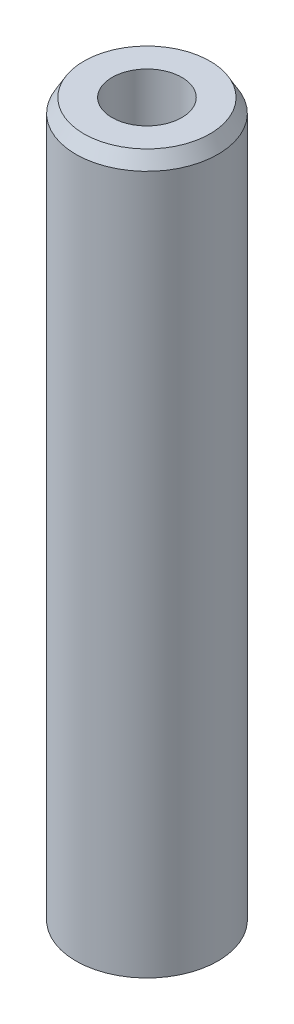
ISO-10303-21;
HEADER;
FILE_DESCRIPTION(('STEP AP214'),'2;1');
FILE_NAME('part.step','',(''),(''),'','','');
FILE_SCHEMA(('AUTOMOTIVE_DESIGN { 1 0 10303 214 1 1 1 1 }'));
ENDSEC;
DATA;
#1=APPLICATION_CONTEXT('core data for automotive mechanical design processes');
#2=APPLICATION_PROTOCOL_DEFINITION('international standard','automotive_design',2000,#1);
#3=PRODUCT_CONTEXT('',#1,'mechanical');
#4=PRODUCT('Part','Part','',(#3));
#5=PRODUCT_RELATED_PRODUCT_CATEGORY('part','',(#4));
#6=PRODUCT_DEFINITION_FORMATION('','',#4);
#7=PRODUCT_DEFINITION_CONTEXT('part definition',#1,'design');
#8=PRODUCT_DEFINITION('design','',#6,#7);
#9=PRODUCT_DEFINITION_SHAPE('','',#8);
#10=(LENGTH_UNIT() NAMED_UNIT(*) SI_UNIT(.MILLI.,.METRE.));
#11=(NAMED_UNIT(*) PLANE_ANGLE_UNIT() SI_UNIT($,.RADIAN.));
#12=(NAMED_UNIT(*) SI_UNIT($,.STERADIAN.) SOLID_ANGLE_UNIT());
#13=UNCERTAINTY_MEASURE_WITH_UNIT(LENGTH_MEASURE(1.E-05),#10,'distance_accuracy_value','');
#14=(GEOMETRIC_REPRESENTATION_CONTEXT(3) GLOBAL_UNCERTAINTY_ASSIGNED_CONTEXT((#13)) GLOBAL_UNIT_ASSIGNED_CONTEXT((#10,
#11,#12)) REPRESENTATION_CONTEXT('',''));
#15=CARTESIAN_POINT('',(0.,0.,0.));
#16=DIRECTION('',(0.,0.,1.));
#17=DIRECTION('',(1.,0.,0.));
#18=AXIS2_PLACEMENT_3D('',#15,#16,#17);
#19=CARTESIAN_POINT('',(0.,101.453979881851,0.));
#20=DIRECTION('',(0.,-1.,0.));
#21=DIRECTION('',(0.,0.,-1.));
#22=AXIS2_PLACEMENT_3D('',#19,#20,#21);
#23=CYLINDRICAL_SURFACE('',#22,10.);
#24=CARTESIAN_POINT('',(0.,99.51363337453,0.));
#25=DIRECTION('',(0.,1.,0.));
#26=DIRECTION('',(0.,0.,1.));
#27=AXIS2_PLACEMENT_3D('',#24,#25,#26);
#28=CIRCLE('',#27,10.);
#29=CARTESIAN_POINT('',(0.,99.51363337453,10.));
#30=VERTEX_POINT('',#29);
#31=EDGE_CURVE('E50',#30,#30,#28,.F.);
#32=ORIENTED_EDGE('',*,*,#31,.T.);
#33=EDGE_LOOP('',(#32));
#34=FACE_BOUND('',#33,.T.);
#35=CARTESIAN_POINT('',(0.,1.12025957832319,0.));
#36=DIRECTION('',(0.,1.,0.));
#37=DIRECTION('',(0.,0.,1.));
#38=AXIS2_PLACEMENT_3D('',#35,#36,#37);
#39=CIRCLE('',#38,10.);
#40=CARTESIAN_POINT('',(0.,1.12025957832319,10.));
#41=VERTEX_POINT('',#40);
#42=EDGE_CURVE('E51',#41,#41,#39,.T.);
#43=ORIENTED_EDGE('',*,*,#42,.T.);
#44=EDGE_LOOP('',(#43));
#45=FACE_BOUND('',#44,.T.);
#46=ADVANCED_FACE('F39',(#34,#45),#23,.T.);
#47=CARTESIAN_POINT('',(0.,101.453979881851,0.));
#48=DIRECTION('',(0.,1.,0.));
#49=DIRECTION('',(0.,0.,1.));
#50=AXIS2_PLACEMENT_3D('',#47,#48,#49);
#51=PLANE('',#50);
#52=CARTESIAN_POINT('',(0.,101.453979881851,0.));
#53=DIRECTION('',(0.,1.,0.));
#54=DIRECTION('',(0.,0.,1.));
#55=AXIS2_PLACEMENT_3D('',#52,#53,#54);
#56=CIRCLE('',#55,8.87974042167679);
#57=CARTESIAN_POINT('',(0.,101.453979881851,8.87974042167679));
#58=VERTEX_POINT('',#57);
#59=EDGE_CURVE('E54',#58,#58,#56,.T.);
#60=ORIENTED_EDGE('',*,*,#59,.T.);
#61=EDGE_LOOP('',(#60));
#62=FACE_BOUND('',#61,.T.);
#63=CARTESIAN_POINT('',(0.,101.453979881851,0.));
#64=DIRECTION('',(0.,1.,0.));
#65=DIRECTION('',(0.,0.,1.));
#66=AXIS2_PLACEMENT_3D('',#63,#64,#65);
#67=CIRCLE('',#66,4.91432306911751);
#68=CARTESIAN_POINT('',(0.,101.453979881851,4.91432306911751));
#69=VERTEX_POINT('',#68);
#70=EDGE_CURVE('E58',#69,#69,#67,.T.);
#71=ORIENTED_EDGE('',*,*,#70,.F.);
#72=EDGE_LOOP('',(#71));
#73=FACE_BOUND('',#72,.T.);
#74=ADVANCED_FACE('F69',(#62,#73),#51,.T.);
#75=CARTESIAN_POINT('',(0.,0.,0.));
#76=DIRECTION('',(0.,1.,0.));
#77=DIRECTION('',(0.,0.,1.));
#78=AXIS2_PLACEMENT_3D('',#75,#76,#77);
#79=PLANE('',#78);
#80=CARTESIAN_POINT('',(0.,0.,0.));
#81=DIRECTION('',(0.,1.,0.));
#82=DIRECTION('',(0.,0.,1.));
#83=AXIS2_PLACEMENT_3D('',#80,#81,#82);
#84=CIRCLE('',#83,8.05965349267854);
#85=CARTESIAN_POINT('',(0.,0.,8.05965349267854));
#86=VERTEX_POINT('',#85);
#87=EDGE_CURVE('E10',#86,#86,#84,.F.);
#88=ORIENTED_EDGE('',*,*,#87,.T.);
#89=EDGE_LOOP('',(#88));
#90=FACE_BOUND('',#89,.T.);
#91=CARTESIAN_POINT('',(0.,0.,0.));
#92=DIRECTION('',(0.,1.,0.));
#93=DIRECTION('',(0.,0.,1.));
#94=AXIS2_PLACEMENT_3D('',#91,#92,#93);
#95=CIRCLE('',#94,4.91432306911751);
#96=CARTESIAN_POINT('',(0.,0.,4.91432306911751));
#97=VERTEX_POINT('',#96);
#98=EDGE_CURVE('E63',#97,#97,#95,.T.);
#99=ORIENTED_EDGE('',*,*,#98,.T.);
#100=EDGE_LOOP('',(#99));
#101=FACE_BOUND('',#100,.T.);
#102=ADVANCED_FACE('F75',(#90,#101),#79,.F.);
#103=CARTESIAN_POINT('',(0.,101.453979881851,0.));
#104=DIRECTION('',(0.,-1.,0.));
#105=DIRECTION('',(0.,0.,-1.));
#106=AXIS2_PLACEMENT_3D('',#103,#104,#105);
#107=CYLINDRICAL_SURFACE('',#106,4.91432306911751);
#108=ORIENTED_EDGE('',*,*,#70,.T.);
#109=EDGE_LOOP('',(#108));
#110=FACE_BOUND('',#109,.T.);
#111=ORIENTED_EDGE('',*,*,#98,.F.);
#112=EDGE_LOOP('',(#111));
#113=FACE_BOUND('',#112,.T.);
#114=ADVANCED_FACE('F70',(#110,#113),#107,.F.);
#115=CARTESIAN_POINT('',(0.,101.453979881851,0.));
#116=DIRECTION('',(0.,-1.,0.));
#117=DIRECTION('',(0.,0.,-1.));
#118=AXIS2_PLACEMENT_3D('',#115,#116,#117);
#119=CONICAL_SURFACE('',#118,8.87974042167679,0.523598775598297);
#120=ORIENTED_EDGE('',*,*,#31,.F.);
#121=EDGE_LOOP('',(#120));
#122=FACE_BOUND('',#121,.T.);
#123=ORIENTED_EDGE('',*,*,#59,.F.);
#124=EDGE_LOOP('',(#123));
#125=FACE_BOUND('',#124,.T.);
#126=ADVANCED_FACE('F81',(#122,#125),#119,.T.);
#127=CARTESIAN_POINT('',(0.,1.12025957832319,0.));
#128=DIRECTION('',(0.,1.,0.));
#129=DIRECTION('',(0.,0.,1.));
#130=AXIS2_PLACEMENT_3D('',#127,#128,#129);
#131=CONICAL_SURFACE('',#130,10.,1.0471975511966);
#132=CARTESIAN_POINT('',(0.,0.,8.05965349267854));
#133=CARTESIAN_POINT('',(0.,0.0116693706075331,8.07986543546313));
#134=CARTESIAN_POINT('',(0.,0.0233387412150663,8.10007737824773));
#135=CARTESIAN_POINT('',(0.,0.0466774824301328,8.14050126381693));
#136=CARTESIAN_POINT('',(0.,0.0583468530376661,8.16071320660153));
#137=CARTESIAN_POINT('',(0.,0.0816855942527327,8.20113709217073));
#138=CARTESIAN_POINT('',(0.,0.0933549648602661,8.22134903495532));
#139=CARTESIAN_POINT('',(0.,0.116693706075333,8.26177292052452));
#140=CARTESIAN_POINT('',(0.,0.128363076682866,8.28198486330912));
#141=CARTESIAN_POINT('',(0.,0.151701817897932,8.32240874887832));
#142=CARTESIAN_POINT('',(0.,0.163371188505465,8.34262069166292));
#143=CARTESIAN_POINT('',(0.,0.186709929720532,8.38304457723211));
#144=CARTESIAN_POINT('',(0.,0.198379300328065,8.40325652001671));
#145=CARTESIAN_POINT('',(0.,0.221718041543132,8.44368040558591));
#146=CARTESIAN_POINT('',(0.,0.233387412150665,8.46389234837051));
#147=CARTESIAN_POINT('',(0.,0.256726153365732,8.5043162339397));
#148=CARTESIAN_POINT('',(0.,0.268395523973265,8.5245281767243));
#149=CARTESIAN_POINT('',(0.,0.291734265188331,8.5649520622935));
#150=CARTESIAN_POINT('',(0.,0.303403635795865,8.5851640050781));
#151=CARTESIAN_POINT('',(0.,0.326742377010931,8.6255878906473));
#152=CARTESIAN_POINT('',(0.,0.338411747618465,8.6457998334319));
#153=CARTESIAN_POINT('',(0.,0.361750488833531,8.68622371900109));
#154=CARTESIAN_POINT('',(0.,0.373419859441064,8.70643566178569));
#155=CARTESIAN_POINT('',(0.,0.396758600656131,8.74685954735489));
#156=CARTESIAN_POINT('',(0.,0.408427971263664,8.76707149013949));
#157=CARTESIAN_POINT('',(0.,0.431766712478731,8.80749537570868));
#158=CARTESIAN_POINT('',(0.,0.443436083086264,8.82770731849328));
#159=CARTESIAN_POINT('',(0.,0.46677482430133,8.86813120406248));
#160=CARTESIAN_POINT('',(0.,0.478444194908864,8.88834314684708));
#161=CARTESIAN_POINT('',(0.,0.50178293612393,8.92876703241627));
#162=CARTESIAN_POINT('',(0.,0.513452306731463,8.94897897520087));
#163=CARTESIAN_POINT('',(0.,0.53679104794653,8.98940286077007));
#164=CARTESIAN_POINT('',(0.,0.548460418554063,9.00961480355467));
#165=CARTESIAN_POINT('',(0.,0.57179915976913,9.05003868912387));
#166=CARTESIAN_POINT('',(0.,0.583468530376663,9.07025063190846));
#167=CARTESIAN_POINT('',(0.,0.606807271591729,9.11067451747766));
#168=CARTESIAN_POINT('',(0.,0.618476642199263,9.13088646026226));
#169=CARTESIAN_POINT('',(0.,0.64181538341433,9.17131034583146));
#170=CARTESIAN_POINT('',(0.,0.653484754021863,9.19152228861606));
#171=CARTESIAN_POINT('',(0.,0.676823495236929,9.23194617418525));
#172=CARTESIAN_POINT('',(0.,0.688492865844462,9.25215811696985));
#173=CARTESIAN_POINT('',(0.,0.711831607059529,9.29258200253905));
#174=CARTESIAN_POINT('',(0.,0.723500977667062,9.31279394532365));
#175=CARTESIAN_POINT('',(0.,0.746839718882129,9.35321783089285));
#176=CARTESIAN_POINT('',(0.,0.758509089489662,9.37342977367744));
#177=CARTESIAN_POINT('',(0.,0.781847830704729,9.41385365924664));
#178=CARTESIAN_POINT('',(0.,0.793517201312262,9.43406560203124));
#179=CARTESIAN_POINT('',(0.,0.816855942527328,9.47448948760044));
#180=CARTESIAN_POINT('',(0.,0.828525313134862,9.49470143038504));
#181=CARTESIAN_POINT('',(0.,0.851864054349928,9.53512531595423));
#182=CARTESIAN_POINT('',(0.,0.863533424957462,9.55533725873883));
#183=CARTESIAN_POINT('',(0.,0.886872166172528,9.59576114430803));
#184=CARTESIAN_POINT('',(0.,0.898541536780061,9.61597308709263));
#185=CARTESIAN_POINT('',(0.,0.921880277995128,9.65639697266182));
#186=CARTESIAN_POINT('',(0.,0.933549648602661,9.67660891544642));
#187=CARTESIAN_POINT('',(0.,0.956888389817728,9.71703280101562));
#188=CARTESIAN_POINT('',(0.,0.968557760425261,9.73724474380022));
#189=CARTESIAN_POINT('',(0.,0.991896501640327,9.77766862936942));
#190=CARTESIAN_POINT('',(0.,1.00356587224786,9.79788057215402));
#191=CARTESIAN_POINT('',(0.,1.02690461346293,9.83830445772321));
#192=CARTESIAN_POINT('',(0.,1.03857398407046,9.85851640050781));
#193=CARTESIAN_POINT('',(0.,1.06191272528553,9.89894028607701));
#194=CARTESIAN_POINT('',(0.,1.07358209589306,9.91915222886161));
#195=CARTESIAN_POINT('',(0.,1.09692083710813,9.9595761144308));
#196=CARTESIAN_POINT('',(0.,1.10859020771566,9.9797880572154));
#197=CARTESIAN_POINT('',(0.,1.12025957832319,10.));
#198=B_SPLINE_CURVE_WITH_KNOTS('',3,(#132,#133,#134,#135,#136,#137,#138,#139,#140,#141,#142,
#143,#144,#145,#146,#147,#148,#149,#150,#151,#152,#153,#154,#155,#156,#157,#158,#159,#160,#161,
#162,#163,#164,#165,#166,#167,#168,#169,#170,#171,#172,#173,#174,#175,#176,#177,#178,#179,#180,
#181,#182,#183,#184,#185,#186,#187,#188,#189,#190,#191,#192,#193,#194,#195,#196,#197),
.UNSPECIFIED.,.F.,.F.,(4,2,2,2,2,2,2,2,2,2,2,2,2,2,2,2,2,2,2,2,2,2,2,2,2,2,2,2,2,2,2,2,4),(0.,
0.0700162236451992,0.140032447290398,0.210048670935598,0.280064894580798,0.350081118225998,
0.420097341871198,0.490113565516398,0.560129789161597,0.630146012806798,0.700162236451997,
0.770178460097198,0.840194683742397,0.910210907387596,0.980227131032795,1.050243354678,
1.1202595783232,1.1902758019684,1.2602920256136,1.33030824925879,1.40032447290399,
1.47034069654919,1.54035692019439,1.61037314383959,1.68038936748479,1.75040559112999,
1.82042181477519,1.89043803842039,1.96045426206559,2.03047048571079,2.10048670935599,
2.17050293300119,2.24051915664639),.UNSPECIFIED.);
#199=EDGE_CURVE('BSEAM45',#86,#41,#198,.T.);
#200=ORIENTED_EDGE('',*,*,#87,.F.);
#201=ORIENTED_EDGE('',*,*,#42,.F.);
#202=ORIENTED_EDGE('',*,*,#199,.T.);
#203=ORIENTED_EDGE('',*,*,#199,.F.);
#204=EDGE_LOOP('',(#200,#202,#201,#203));
#205=FACE_BOUND('',#204,.T.);
#206=ADVANCED_FACE('F45',(#205),#131,.T.);
#207=CLOSED_SHELL('',(#46,#74,#102,#114,#126,#206));
#208=MANIFOLD_SOLID_BREP('B2',#207);
#209=ADVANCED_BREP_SHAPE_REPRESENTATION('',(#18,#208),#14);
#210=SHAPE_DEFINITION_REPRESENTATION(#9,#209);
ENDSEC;
END-ISO-10303-21;
